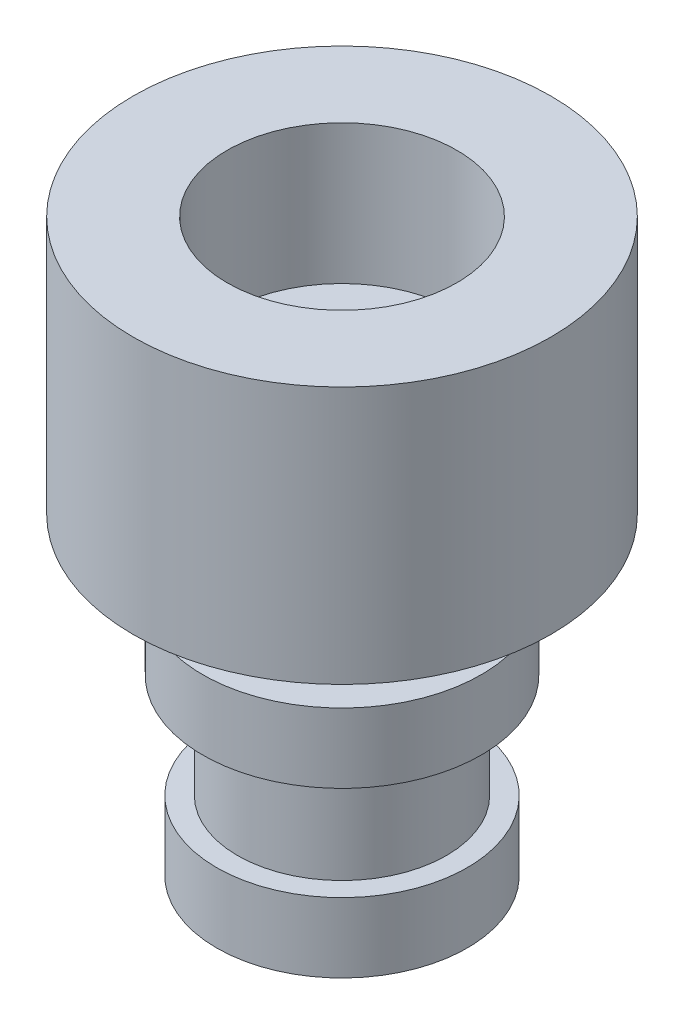
ISO-10303-21;
HEADER;
FILE_DESCRIPTION(('STEP AP214'),'2;1');
FILE_NAME('part.step','',(''),(''),'','','');
FILE_SCHEMA(('AUTOMOTIVE_DESIGN { 1 0 10303 214 1 1 1 1 }'));
ENDSEC;
DATA;
#1=APPLICATION_CONTEXT('core data for automotive mechanical design processes');
#2=APPLICATION_PROTOCOL_DEFINITION('international standard','automotive_design',2000,#1);
#3=PRODUCT_CONTEXT('',#1,'mechanical');
#4=PRODUCT('Part','Part','',(#3));
#5=PRODUCT_RELATED_PRODUCT_CATEGORY('part','',(#4));
#6=PRODUCT_DEFINITION_FORMATION('','',#4);
#7=PRODUCT_DEFINITION_CONTEXT('part definition',#1,'design');
#8=PRODUCT_DEFINITION('design','',#6,#7);
#9=PRODUCT_DEFINITION_SHAPE('','',#8);
#10=(LENGTH_UNIT() NAMED_UNIT(*) SI_UNIT(.MILLI.,.METRE.));
#11=(NAMED_UNIT(*) PLANE_ANGLE_UNIT() SI_UNIT($,.RADIAN.));
#12=(NAMED_UNIT(*) SI_UNIT($,.STERADIAN.) SOLID_ANGLE_UNIT());
#13=UNCERTAINTY_MEASURE_WITH_UNIT(LENGTH_MEASURE(1.E-05),#10,'distance_accuracy_value','');
#14=(GEOMETRIC_REPRESENTATION_CONTEXT(3) GLOBAL_UNCERTAINTY_ASSIGNED_CONTEXT((#13)) GLOBAL_UNIT_ASSIGNED_CONTEXT((#10,
#11,#12)) REPRESENTATION_CONTEXT('',''));
#15=CARTESIAN_POINT('',(0.,0.,0.));
#16=DIRECTION('',(0.,0.,1.));
#17=DIRECTION('',(1.,0.,0.));
#18=AXIS2_PLACEMENT_3D('',#15,#16,#17);
#19=CARTESIAN_POINT('',(-0.522013311509166,-4.5,-0.51113803418606));
#20=DIRECTION('',(0.,1.,0.));
#21=DIRECTION('',(0.,0.,1.));
#22=AXIS2_PLACEMENT_3D('',#19,#20,#21);
#23=CYLINDRICAL_SURFACE('',#22,1.5);
#24=CARTESIAN_POINT('',(-0.522013311509166,-2.,-0.51113803418606));
#25=DIRECTION('',(0.,-1.,0.));
#26=DIRECTION('',(0.,0.,-1.));
#27=AXIS2_PLACEMENT_3D('',#24,#25,#26);
#28=CIRCLE('',#27,1.5);
#29=CARTESIAN_POINT('',(-0.522013311509166,-2.,-2.01113803418606));
#30=VERTEX_POINT('',#29);
#31=EDGE_CURVE('E53',#30,#30,#28,.T.);
#32=ORIENTED_EDGE('',*,*,#31,.T.);
#33=EDGE_LOOP('',(#32));
#34=FACE_BOUND('',#33,.T.);
#35=CARTESIAN_POINT('',(-0.522013311509166,-3.5,-0.51113803418606));
#36=DIRECTION('',(0.,-1.,0.));
#37=DIRECTION('',(0.,0.,-1.));
#38=AXIS2_PLACEMENT_3D('',#35,#36,#37);
#39=CIRCLE('',#38,1.5);
#40=CARTESIAN_POINT('',(-0.522013311509166,-3.5,-2.01113803418606));
#41=VERTEX_POINT('',#40);
#42=EDGE_CURVE('E10',#41,#41,#39,.T.);
#43=ORIENTED_EDGE('',*,*,#42,.F.);
#44=EDGE_LOOP('',(#43));
#45=FACE_BOUND('',#44,.T.);
#46=ADVANCED_FACE('F45',(#34,#45),#23,.T.);
#47=CARTESIAN_POINT('',(-0.522013311509166,3.7,-0.51113803418606));
#48=DIRECTION('',(0.,-1.,0.));
#49=DIRECTION('',(0.,0.,-1.));
#50=AXIS2_PLACEMENT_3D('',#47,#48,#49);
#51=CYLINDRICAL_SURFACE('',#50,3.);
#52=CARTESIAN_POINT('',(-0.522013311509166,3.7,-0.51113803418606));
#53=DIRECTION('',(0.,1.,0.));
#54=DIRECTION('',(0.,0.,1.));
#55=AXIS2_PLACEMENT_3D('',#52,#53,#54);
#56=CIRCLE('',#55,3.);
#57=CARTESIAN_POINT('',(-0.522013311509166,3.7,2.48886196581394));
#58=VERTEX_POINT('',#57);
#59=EDGE_CURVE('E64',#58,#58,#56,.T.);
#60=ORIENTED_EDGE('',*,*,#59,.F.);
#61=EDGE_LOOP('',(#60));
#62=FACE_BOUND('',#61,.T.);
#63=CARTESIAN_POINT('',(-0.522013311509166,0.,-0.51113803418606));
#64=DIRECTION('',(0.,1.,0.));
#65=DIRECTION('',(0.,0.,1.));
#66=AXIS2_PLACEMENT_3D('',#63,#64,#65);
#67=CIRCLE('',#66,3.);
#68=CARTESIAN_POINT('',(-0.522013311509166,0.,2.48886196581394));
#69=VERTEX_POINT('',#68);
#70=EDGE_CURVE('E82',#69,#69,#67,.T.);
#71=ORIENTED_EDGE('',*,*,#70,.T.);
#72=EDGE_LOOP('',(#71));
#73=FACE_BOUND('',#72,.T.);
#74=ADVANCED_FACE('F47',(#62,#73),#51,.T.);
#75=CARTESIAN_POINT('',(-0.522013311509166,3.7,-0.51113803418606));
#76=DIRECTION('',(0.,1.,0.));
#77=DIRECTION('',(0.,0.,1.));
#78=AXIS2_PLACEMENT_3D('',#75,#76,#77);
#79=PLANE('',#78);
#80=CARTESIAN_POINT('',(-0.522013311509166,3.7,-0.51113803418606));
#81=DIRECTION('',(0.,1.,0.));
#82=DIRECTION('',(0.,0.,1.));
#83=AXIS2_PLACEMENT_3D('',#80,#81,#82);
#84=CIRCLE('',#83,1.65);
#85=CARTESIAN_POINT('',(-0.522013311509166,3.7,1.13886196581394));
#86=VERTEX_POINT('',#85);
#87=EDGE_CURVE('E255',#86,#86,#84,.T.);
#88=ORIENTED_EDGE('',*,*,#87,.F.);
#89=EDGE_LOOP('',(#88));
#90=FACE_BOUND('',#89,.T.);
#91=ORIENTED_EDGE('',*,*,#59,.T.);
#92=EDGE_LOOP('',(#91));
#93=FACE_BOUND('',#92,.T.);
#94=ADVANCED_FACE('F94',(#90,#93),#79,.T.);
#95=CARTESIAN_POINT('',(-0.522013311509166,0.,-0.51113803418606));
#96=DIRECTION('',(0.,1.,0.));
#97=DIRECTION('',(0.,0.,1.));
#98=AXIS2_PLACEMENT_3D('',#95,#96,#97);
#99=PLANE('',#98);
#100=CARTESIAN_POINT('',(-0.522013311509166,0.,-0.51113803418606));
#101=DIRECTION('',(0.,-1.,0.));
#102=DIRECTION('',(0.,0.,-1.));
#103=AXIS2_PLACEMENT_3D('',#100,#101,#102);
#104=CIRCLE('',#103,1.5);
#105=CARTESIAN_POINT('',(-0.522013311509166,0.,-2.01113803418606));
#106=VERTEX_POINT('',#105);
#107=EDGE_CURVE('E58',#106,#106,#104,.T.);
#108=ORIENTED_EDGE('',*,*,#107,.F.);
#109=EDGE_LOOP('',(#108));
#110=FACE_BOUND('',#109,.T.);
#111=ORIENTED_EDGE('',*,*,#70,.F.);
#112=EDGE_LOOP('',(#111));
#113=FACE_BOUND('',#112,.T.);
#114=ADVANCED_FACE('F91',(#110,#113),#99,.F.);
#115=CARTESIAN_POINT('',(-0.522013311509166,-1.,-0.51113803418606));
#116=DIRECTION('',(0.,1.,0.));
#117=DIRECTION('',(0.,0.,1.));
#118=AXIS2_PLACEMENT_3D('',#115,#116,#117);
#119=CYLINDRICAL_SURFACE('',#118,1.5);
#120=CARTESIAN_POINT('',(-0.522013311509166,-1.,-0.51113803418606));
#121=DIRECTION('',(0.,-1.,0.));
#122=DIRECTION('',(0.,0.,-1.));
#123=AXIS2_PLACEMENT_3D('',#120,#121,#122);
#124=CIRCLE('',#123,1.5);
#125=CARTESIAN_POINT('',(-0.522013311509166,-1.,-2.01113803418606));
#126=VERTEX_POINT('',#125);
#127=EDGE_CURVE('E74',#126,#126,#124,.T.);
#128=ORIENTED_EDGE('',*,*,#127,.F.);
#129=EDGE_LOOP('',(#128));
#130=FACE_BOUND('',#129,.T.);
#131=ORIENTED_EDGE('',*,*,#107,.T.);
#132=EDGE_LOOP('',(#131));
#133=FACE_BOUND('',#132,.T.);
#134=ADVANCED_FACE('F93',(#130,#133),#119,.T.);
#135=CARTESIAN_POINT('',(-0.522013311509166,-2.,-0.51113803418606));
#136=DIRECTION('',(0.,1.,0.));
#137=DIRECTION('',(0.,0.,1.));
#138=AXIS2_PLACEMENT_3D('',#135,#136,#137);
#139=CYLINDRICAL_SURFACE('',#138,2.);
#140=CARTESIAN_POINT('',(-0.522013311509166,-2.,-0.51113803418606));
#141=DIRECTION('',(0.,-1.,0.));
#142=DIRECTION('',(0.,0.,-1.));
#143=AXIS2_PLACEMENT_3D('',#140,#141,#142);
#144=CIRCLE('',#143,2.);
#145=CARTESIAN_POINT('',(-0.522013311509166,-2.,-2.51113803418606));
#146=VERTEX_POINT('',#145);
#147=EDGE_CURVE('E70',#146,#146,#144,.T.);
#148=ORIENTED_EDGE('',*,*,#147,.F.);
#149=EDGE_LOOP('',(#148));
#150=FACE_BOUND('',#149,.T.);
#151=CARTESIAN_POINT('',(-0.522013311509166,-1.,-0.51113803418606));
#152=DIRECTION('',(0.,-1.,0.));
#153=DIRECTION('',(0.,0.,-1.));
#154=AXIS2_PLACEMENT_3D('',#151,#152,#153);
#155=CIRCLE('',#154,2.);
#156=CARTESIAN_POINT('',(-0.522013311509166,-1.,-2.51113803418606));
#157=VERTEX_POINT('',#156);
#158=EDGE_CURVE('E75',#157,#157,#155,.T.);
#159=ORIENTED_EDGE('',*,*,#158,.T.);
#160=EDGE_LOOP('',(#159));
#161=FACE_BOUND('',#160,.T.);
#162=ADVANCED_FACE('F100',(#150,#161),#139,.T.);
#163=CARTESIAN_POINT('',(-0.522013311509166,-2.,-0.51113803418606));
#164=DIRECTION('',(0.,-1.,0.));
#165=DIRECTION('',(0.,0.,-1.));
#166=AXIS2_PLACEMENT_3D('',#163,#164,#165);
#167=PLANE('',#166);
#168=ORIENTED_EDGE('',*,*,#31,.F.);
#169=EDGE_LOOP('',(#168));
#170=FACE_BOUND('',#169,.T.);
#171=ORIENTED_EDGE('',*,*,#147,.T.);
#172=EDGE_LOOP('',(#171));
#173=FACE_BOUND('',#172,.T.);
#174=ADVANCED_FACE('F117',(#170,#173),#167,.T.);
#175=CARTESIAN_POINT('',(-0.522013311509166,-1.,-0.51113803418606));
#176=DIRECTION('',(0.,-1.,0.));
#177=DIRECTION('',(0.,0.,-1.));
#178=AXIS2_PLACEMENT_3D('',#175,#176,#177);
#179=PLANE('',#178);
#180=ORIENTED_EDGE('',*,*,#127,.T.);
#181=EDGE_LOOP('',(#180));
#182=FACE_BOUND('',#181,.T.);
#183=ORIENTED_EDGE('',*,*,#158,.F.);
#184=EDGE_LOOP('',(#183));
#185=FACE_BOUND('',#184,.T.);
#186=ADVANCED_FACE('F120',(#182,#185),#179,.F.);
#187=CARTESIAN_POINT('',(-0.522013311509166,-3.5,-0.51113803418606));
#188=DIRECTION('',(0.,-1.,0.));
#189=DIRECTION('',(0.,0.,-1.));
#190=AXIS2_PLACEMENT_3D('',#187,#188,#189);
#191=CYLINDRICAL_SURFACE('',#190,1.8);
#192=CARTESIAN_POINT('',(-0.522013311509166,-3.5,-0.51113803418606));
#193=DIRECTION('',(0.,-1.,0.));
#194=DIRECTION('',(0.,0.,-1.));
#195=AXIS2_PLACEMENT_3D('',#192,#193,#194);
#196=CIRCLE('',#195,1.8);
#197=CARTESIAN_POINT('',(-0.522013311509166,-3.5,-2.31113803418606));
#198=VERTEX_POINT('',#197);
#199=EDGE_CURVE('E79',#198,#198,#196,.T.);
#200=ORIENTED_EDGE('',*,*,#199,.T.);
#201=EDGE_LOOP('',(#200));
#202=FACE_BOUND('',#201,.T.);
#203=CARTESIAN_POINT('',(-0.522013311509166,-4.5,-0.51113803418606));
#204=DIRECTION('',(0.,-1.,0.));
#205=DIRECTION('',(0.,0.,-1.));
#206=AXIS2_PLACEMENT_3D('',#203,#204,#205);
#207=CIRCLE('',#206,1.8);
#208=CARTESIAN_POINT('',(-0.522013311509166,-4.5,-2.31113803418606));
#209=VERTEX_POINT('',#208);
#210=EDGE_CURVE('E68',#209,#209,#207,.T.);
#211=ORIENTED_EDGE('',*,*,#210,.F.);
#212=EDGE_LOOP('',(#211));
#213=FACE_BOUND('',#212,.T.);
#214=ADVANCED_FACE('F124',(#202,#213),#191,.T.);
#215=CARTESIAN_POINT('',(-0.522013311509166,-3.5,-0.51113803418606));
#216=DIRECTION('',(0.,-1.,0.));
#217=DIRECTION('',(0.,0.,-1.));
#218=AXIS2_PLACEMENT_3D('',#215,#216,#217);
#219=PLANE('',#218);
#220=ORIENTED_EDGE('',*,*,#42,.T.);
#221=EDGE_LOOP('',(#220));
#222=FACE_BOUND('',#221,.T.);
#223=ORIENTED_EDGE('',*,*,#199,.F.);
#224=EDGE_LOOP('',(#223));
#225=FACE_BOUND('',#224,.T.);
#226=ADVANCED_FACE('F151',(#222,#225),#219,.F.);
#227=CARTESIAN_POINT('',(-0.522013311509166,-4.5,-0.51113803418606));
#228=DIRECTION('',(0.,-1.,0.));
#229=DIRECTION('',(0.,0.,-1.));
#230=AXIS2_PLACEMENT_3D('',#227,#228,#229);
#231=PLANE('',#230);
#232=ORIENTED_EDGE('',*,*,#210,.T.);
#233=EDGE_LOOP('',(#232));
#234=FACE_BOUND('',#233,.T.);
#235=ADVANCED_FACE('F115',(#234),#231,.T.);
#236=CARTESIAN_POINT('',(-0.522013311509166,1.7,-0.51113803418606));
#237=DIRECTION('',(0.,1.,0.));
#238=DIRECTION('',(0.,0.,1.));
#239=AXIS2_PLACEMENT_3D('',#236,#237,#238);
#240=CYLINDRICAL_SURFACE('',#239,1.65);
#241=CARTESIAN_POINT('',(-0.522013311509166,1.7,-0.51113803418606));
#242=DIRECTION('',(0.,1.,0.));
#243=DIRECTION('',(0.,0.,1.));
#244=AXIS2_PLACEMENT_3D('',#241,#242,#243);
#245=CIRCLE('',#244,1.65);
#246=CARTESIAN_POINT('',(-0.522013311509166,1.7,1.13886196581394));
#247=VERTEX_POINT('',#246);
#248=EDGE_CURVE('E253',#247,#247,#245,.T.);
#249=ORIENTED_EDGE('',*,*,#248,.F.);
#250=EDGE_LOOP('',(#249));
#251=FACE_BOUND('',#250,.T.);
#252=ORIENTED_EDGE('',*,*,#87,.T.);
#253=EDGE_LOOP('',(#252));
#254=FACE_BOUND('',#253,.T.);
#255=ADVANCED_FACE('F164',(#251,#254),#240,.F.);
#256=CARTESIAN_POINT('',(-0.522013311509166,1.7,-0.51113803418606));
#257=DIRECTION('',(0.,1.,0.));
#258=DIRECTION('',(0.,0.,1.));
#259=AXIS2_PLACEMENT_3D('',#256,#257,#258);
#260=PLANE('',#259);
#261=ORIENTED_EDGE('',*,*,#248,.T.);
#262=EDGE_LOOP('',(#261));
#263=FACE_BOUND('',#262,.T.);
#264=ADVANCED_FACE('F172',(#263),#260,.T.);
#265=CLOSED_SHELL('',(#46,#74,#94,#114,#134,#162,#174,#186,#214,#226,#235,#255,#264));
#266=MANIFOLD_SOLID_BREP('B2',#265);
#267=ADVANCED_BREP_SHAPE_REPRESENTATION('',(#18,#266),#14);
#268=SHAPE_DEFINITION_REPRESENTATION(#9,#267);
ENDSEC;
END-ISO-10303-21;
